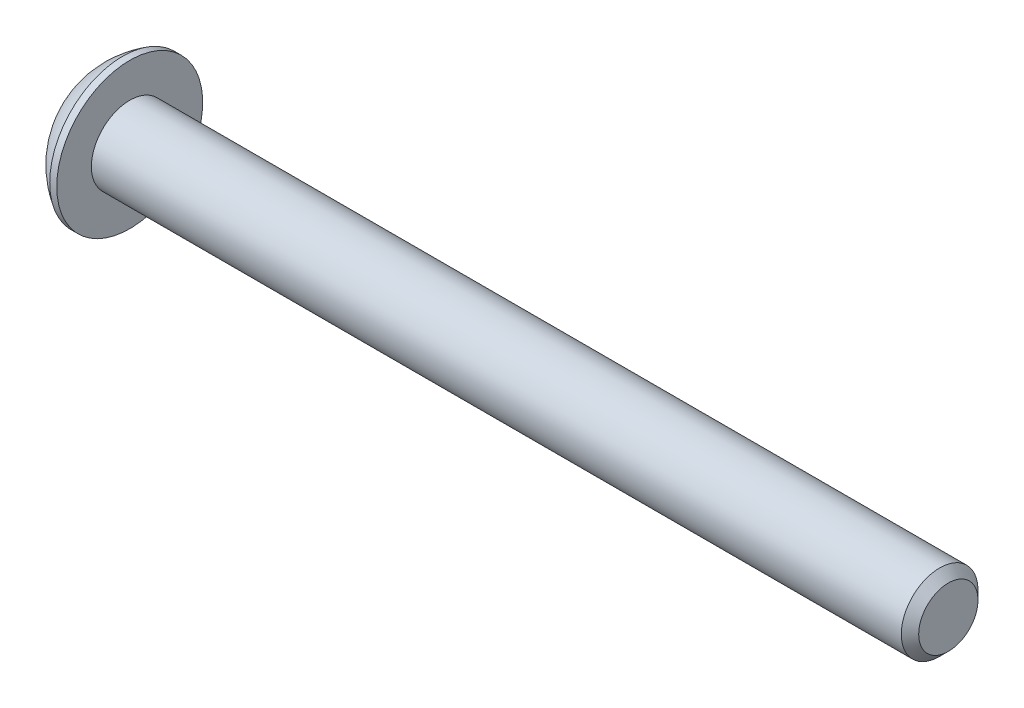
ISO-10303-21;
HEADER;
FILE_DESCRIPTION(('STEP AP214'),'2;1');
FILE_NAME('part.step','',(''),(''),'','','');
FILE_SCHEMA(('AUTOMOTIVE_DESIGN { 1 0 10303 214 1 1 1 1 }'));
ENDSEC;
DATA;
#1=APPLICATION_CONTEXT('core data for automotive mechanical design processes');
#2=APPLICATION_PROTOCOL_DEFINITION('international standard','automotive_design',2000,#1);
#3=PRODUCT_CONTEXT('',#1,'mechanical');
#4=PRODUCT('Part','Part','',(#3));
#5=PRODUCT_RELATED_PRODUCT_CATEGORY('part','',(#4));
#6=PRODUCT_DEFINITION_FORMATION('','',#4);
#7=PRODUCT_DEFINITION_CONTEXT('part definition',#1,'design');
#8=PRODUCT_DEFINITION('design','',#6,#7);
#9=PRODUCT_DEFINITION_SHAPE('','',#8);
#10=(LENGTH_UNIT() NAMED_UNIT(*) SI_UNIT(.MILLI.,.METRE.));
#11=(NAMED_UNIT(*) PLANE_ANGLE_UNIT() SI_UNIT($,.RADIAN.));
#12=(NAMED_UNIT(*) SI_UNIT($,.STERADIAN.) SOLID_ANGLE_UNIT());
#13=UNCERTAINTY_MEASURE_WITH_UNIT(LENGTH_MEASURE(1.E-05),#10,'distance_accuracy_value','');
#14=(GEOMETRIC_REPRESENTATION_CONTEXT(3) GLOBAL_UNCERTAINTY_ASSIGNED_CONTEXT((#13)) GLOBAL_UNIT_ASSIGNED_CONTEXT((#10,
#11,#12)) REPRESENTATION_CONTEXT('',''));
#15=CARTESIAN_POINT('',(0.,0.,0.));
#16=DIRECTION('',(0.,0.,1.));
#17=DIRECTION('',(1.,0.,0.));
#18=AXIS2_PLACEMENT_3D('',#15,#16,#17);
#19=CARTESIAN_POINT('',(1.32080000000034,0.,0.));
#20=DIRECTION('',(-1.,0.,0.));
#21=DIRECTION('',(0.,0.,1.));
#22=AXIS2_PLACEMENT_3D('',#19,#20,#21);
#23=CONICAL_SURFACE('',#22,1.1937999999998,1.04719755119608);
#24=CARTESIAN_POINT('',(2.01004075135902,0.,4.44089209850063E-13));
#25=VERTEX_POINT('',#24);
#26=VERTEX_LOOP('',#25);
#27=FACE_BOUND('',#26,.T.);
#28=CARTESIAN_POINT('',(1.32080000000009,0.,0.));
#29=DIRECTION('',(-1.,0.,0.));
#30=DIRECTION('',(0.,0.,1.));
#31=AXIS2_PLACEMENT_3D('',#28,#29,#30);
#32=CIRCLE('',#31,1.19380000000024);
#33=CARTESIAN_POINT('',(1.32080000000004,-1.03386112703797,0.59690000000006));
#34=VERTEX_POINT('',#33);
#35=CARTESIAN_POINT('',(1.32080000000004,0.,1.19380000000012));
#36=VERTEX_POINT('',#35);
#37=EDGE_CURVE('E20',#34,#36,#32,.T.);
#38=ORIENTED_EDGE('',*,*,#37,.T.);
#39=CARTESIAN_POINT('',(1.32080000000009,0.,0.));
#40=DIRECTION('',(-1.,0.,0.));
#41=DIRECTION('',(0.,0.,1.));
#42=AXIS2_PLACEMENT_3D('',#39,#40,#41);
#43=CIRCLE('',#42,1.19380000000024);
#44=CARTESIAN_POINT('',(1.32080000000004,1.03386112703797,0.596900000000061));
#45=VERTEX_POINT('',#44);
#46=EDGE_CURVE('E148',#36,#45,#43,.T.);
#47=ORIENTED_EDGE('',*,*,#46,.T.);
#48=CARTESIAN_POINT('',(1.32080000000009,0.,0.));
#49=DIRECTION('',(-1.,0.,0.));
#50=DIRECTION('',(0.,0.,1.));
#51=AXIS2_PLACEMENT_3D('',#48,#49,#50);
#52=CIRCLE('',#51,1.19380000000024);
#53=CARTESIAN_POINT('',(1.32080000000004,1.03386112703797,-0.596900000000061));
#54=VERTEX_POINT('',#53);
#55=EDGE_CURVE('E448',#45,#54,#52,.T.);
#56=ORIENTED_EDGE('',*,*,#55,.T.);
#57=CARTESIAN_POINT('',(1.32080000000009,0.,0.));
#58=DIRECTION('',(-1.,0.,0.));
#59=DIRECTION('',(0.,0.,1.));
#60=AXIS2_PLACEMENT_3D('',#57,#58,#59);
#61=CIRCLE('',#60,1.19380000000024);
#62=CARTESIAN_POINT('',(1.32080000000004,1.49457637585666E-12,-1.19380000000012));
#63=VERTEX_POINT('',#62);
#64=EDGE_CURVE('E449',#54,#63,#61,.T.);
#65=ORIENTED_EDGE('',*,*,#64,.T.);
#66=CARTESIAN_POINT('',(1.32080000000009,0.,0.));
#67=DIRECTION('',(-1.,0.,0.));
#68=DIRECTION('',(0.,0.,1.));
#69=AXIS2_PLACEMENT_3D('',#66,#67,#68);
#70=CIRCLE('',#69,1.19380000000024);
#71=CARTESIAN_POINT('',(1.32080000000004,-1.03386112703797,-0.59690000000006));
#72=VERTEX_POINT('',#71);
#73=EDGE_CURVE('E93',#63,#72,#70,.T.);
#74=ORIENTED_EDGE('',*,*,#73,.T.);
#75=CARTESIAN_POINT('',(1.32080000000009,0.,0.));
#76=DIRECTION('',(-1.,0.,0.));
#77=DIRECTION('',(0.,0.,1.));
#78=AXIS2_PLACEMENT_3D('',#75,#76,#77);
#79=CIRCLE('',#78,1.19380000000024);
#80=EDGE_CURVE('E89',#72,#34,#79,.T.);
#81=ORIENTED_EDGE('',*,*,#80,.T.);
#82=EDGE_LOOP('',(#38,#47,#56,#65,#74,#81));
#83=FACE_BOUND('',#82,.T.);
#84=ADVANCED_FACE('F17',(#27,#83),#23,.F.);
#85=CARTESIAN_POINT('',(1.3208,-2.06772225407572,-1.1938));
#86=DIRECTION('',(1.,0.,0.));
#87=DIRECTION('',(0.,0.,-1.));
#88=AXIS2_PLACEMENT_3D('',#85,#86,#87);
#89=PLANE('',#88);
#90=DIRECTION('',(0.,0.5,0.866025403784439));
#91=VECTOR('',#90,1.);
#92=CARTESIAN_POINT('',(1.3208,-1.37848150271715,0.));
#93=LINE('',#92,#91);
#94=CARTESIAN_POINT('',(1.3208,-0.689240751358574,1.1938));
#95=VERTEX_POINT('',#94);
#96=EDGE_CURVE('E101',#95,#34,#93,.F.);
#97=ORIENTED_EDGE('',*,*,#96,.F.);
#98=DIRECTION('',(0.,1.,0.));
#99=VECTOR('',#98,1.);
#100=CARTESIAN_POINT('',(1.3208,-0.689240751358574,1.1938));
#101=LINE('',#100,#99);
#102=EDGE_CURVE('E103',#36,#95,#101,.F.);
#103=ORIENTED_EDGE('',*,*,#102,.F.);
#104=ORIENTED_EDGE('',*,*,#37,.F.);
#105=EDGE_LOOP('',(#97,#103,#104));
#106=FACE_BOUND('',#105,.T.);
#107=ADVANCED_FACE('F99',(#106),#89,.F.);
#108=CARTESIAN_POINT('',(1.3208,-2.06772225407572,-1.1938));
#109=DIRECTION('',(1.,0.,0.));
#110=DIRECTION('',(0.,0.,-1.));
#111=AXIS2_PLACEMENT_3D('',#108,#109,#110);
#112=PLANE('',#111);
#113=DIRECTION('',(0.,-0.5,0.866025403784439));
#114=VECTOR('',#113,1.);
#115=CARTESIAN_POINT('',(1.3208,-0.689240751358574,-1.1938));
#116=LINE('',#115,#114);
#117=CARTESIAN_POINT('',(1.3208,-1.37848150271715,0.));
#118=VERTEX_POINT('',#117);
#119=EDGE_CURVE('E109',#118,#72,#116,.F.);
#120=ORIENTED_EDGE('',*,*,#119,.F.);
#121=DIRECTION('',(0.,0.5,0.866025403784439));
#122=VECTOR('',#121,1.);
#123=CARTESIAN_POINT('',(1.3208,-1.37848150271715,0.));
#124=LINE('',#123,#122);
#125=EDGE_CURVE('E106',#34,#118,#124,.F.);
#126=ORIENTED_EDGE('',*,*,#125,.F.);
#127=ORIENTED_EDGE('',*,*,#80,.F.);
#128=EDGE_LOOP('',(#120,#126,#127));
#129=FACE_BOUND('',#128,.T.);
#130=ADVANCED_FACE('F107',(#129),#112,.F.);
#131=CARTESIAN_POINT('',(1.3208,-2.06772225407572,-1.1938));
#132=DIRECTION('',(1.,0.,0.));
#133=DIRECTION('',(0.,0.,-1.));
#134=AXIS2_PLACEMENT_3D('',#131,#132,#133);
#135=PLANE('',#134);
#136=DIRECTION('',(0.,1.,0.));
#137=VECTOR('',#136,1.);
#138=CARTESIAN_POINT('',(1.3208,0.689240751358577,-1.1938));
#139=LINE('',#138,#137);
#140=CARTESIAN_POINT('',(1.3208,-0.689240751358574,-1.1938));
#141=VERTEX_POINT('',#140);
#142=EDGE_CURVE('E419',#141,#63,#139,.T.);
#143=ORIENTED_EDGE('',*,*,#142,.F.);
#144=DIRECTION('',(0.,-0.5,0.866025403784439));
#145=VECTOR('',#144,1.);
#146=CARTESIAN_POINT('',(1.3208,-0.689240751358574,-1.1938));
#147=LINE('',#146,#145);
#148=EDGE_CURVE('E431',#72,#141,#147,.F.);
#149=ORIENTED_EDGE('',*,*,#148,.F.);
#150=ORIENTED_EDGE('',*,*,#73,.F.);
#151=EDGE_LOOP('',(#143,#149,#150));
#152=FACE_BOUND('',#151,.T.);
#153=ADVANCED_FACE('F191',(#152),#135,.F.);
#154=CARTESIAN_POINT('',(1.3208,-2.06772225407572,-1.1938));
#155=DIRECTION('',(1.,0.,0.));
#156=DIRECTION('',(0.,0.,-1.));
#157=AXIS2_PLACEMENT_3D('',#154,#155,#156);
#158=PLANE('',#157);
#159=DIRECTION('',(0.,-0.5,-0.866025403784439));
#160=VECTOR('',#159,1.);
#161=CARTESIAN_POINT('',(1.3208,1.37848150271715,0.));
#162=LINE('',#161,#160);
#163=CARTESIAN_POINT('',(1.3208,0.689240751358577,-1.1938));
#164=VERTEX_POINT('',#163);
#165=EDGE_CURVE('E405',#164,#54,#162,.F.);
#166=ORIENTED_EDGE('',*,*,#165,.F.);
#167=DIRECTION('',(0.,1.,0.));
#168=VECTOR('',#167,1.);
#169=CARTESIAN_POINT('',(1.3208,0.689240751358577,-1.1938));
#170=LINE('',#169,#168);
#171=EDGE_CURVE('E416',#63,#164,#170,.T.);
#172=ORIENTED_EDGE('',*,*,#171,.F.);
#173=ORIENTED_EDGE('',*,*,#64,.F.);
#174=EDGE_LOOP('',(#166,#172,#173));
#175=FACE_BOUND('',#174,.T.);
#176=ADVANCED_FACE('F187',(#175),#158,.F.);
#177=CARTESIAN_POINT('',(1.3208,-2.06772225407572,-1.1938));
#178=DIRECTION('',(1.,0.,0.));
#179=DIRECTION('',(0.,0.,-1.));
#180=AXIS2_PLACEMENT_3D('',#177,#178,#179);
#181=PLANE('',#180);
#182=DIRECTION('',(0.,0.5,-0.866025403784439));
#183=VECTOR('',#182,1.);
#184=CARTESIAN_POINT('',(1.3208,0.689240751358576,1.1938));
#185=LINE('',#184,#183);
#186=CARTESIAN_POINT('',(1.3208,1.37848150271715,0.));
#187=VERTEX_POINT('',#186);
#188=EDGE_CURVE('E384',#187,#45,#185,.F.);
#189=ORIENTED_EDGE('',*,*,#188,.F.);
#190=DIRECTION('',(0.,-0.5,-0.866025403784439));
#191=VECTOR('',#190,1.);
#192=CARTESIAN_POINT('',(1.3208,1.37848150271715,0.));
#193=LINE('',#192,#191);
#194=EDGE_CURVE('E403',#54,#187,#193,.F.);
#195=ORIENTED_EDGE('',*,*,#194,.F.);
#196=ORIENTED_EDGE('',*,*,#55,.F.);
#197=EDGE_LOOP('',(#189,#195,#196));
#198=FACE_BOUND('',#197,.T.);
#199=ADVANCED_FACE('F183',(#198),#181,.F.);
#200=CARTESIAN_POINT('',(1.3208,-2.06772225407572,-1.1938));
#201=DIRECTION('',(1.,0.,0.));
#202=DIRECTION('',(0.,0.,-1.));
#203=AXIS2_PLACEMENT_3D('',#200,#201,#202);
#204=PLANE('',#203);
#205=DIRECTION('',(0.,1.,0.));
#206=VECTOR('',#205,1.);
#207=CARTESIAN_POINT('',(1.3208,-0.689240751358574,1.1938));
#208=LINE('',#207,#206);
#209=CARTESIAN_POINT('',(1.3208,0.689240751358576,1.1938));
#210=VERTEX_POINT('',#209);
#211=EDGE_CURVE('E118',#210,#36,#208,.F.);
#212=ORIENTED_EDGE('',*,*,#211,.F.);
#213=DIRECTION('',(0.,0.5,-0.866025403784439));
#214=VECTOR('',#213,1.);
#215=CARTESIAN_POINT('',(1.3208,0.689240751358576,1.1938));
#216=LINE('',#215,#214);
#217=EDGE_CURVE('E387',#45,#210,#216,.F.);
#218=ORIENTED_EDGE('',*,*,#217,.F.);
#219=ORIENTED_EDGE('',*,*,#46,.F.);
#220=EDGE_LOOP('',(#212,#218,#219));
#221=FACE_BOUND('',#220,.T.);
#222=ADVANCED_FACE('F179',(#221),#204,.F.);
#223=CARTESIAN_POINT('',(1.3208,-0.689240751358574,1.1938));
#224=DIRECTION('',(0.,0.,-1.));
#225=DIRECTION('',(0.,1.,0.));
#226=AXIS2_PLACEMENT_3D('',#223,#224,#225);
#227=PLANE('',#226);
#228=DIRECTION('',(0.,1.,0.));
#229=VECTOR('',#228,1.);
#230=CARTESIAN_POINT('',(0.,0.,1.1938));
#231=LINE('',#230,#229);
#232=CARTESIAN_POINT('',(0.,0.689240751358577,1.1938));
#233=VERTEX_POINT('',#232);
#234=CARTESIAN_POINT('',(0.,-0.689240751358574,1.1938));
#235=VERTEX_POINT('',#234);
#236=EDGE_CURVE('E381',#233,#235,#231,.F.);
#237=ORIENTED_EDGE('',*,*,#236,.F.);
#238=DIRECTION('',(1.,0.,0.));
#239=VECTOR('',#238,1.);
#240=CARTESIAN_POINT('',(1.3208,0.689240751358576,1.1938));
#241=LINE('',#240,#239);
#242=EDGE_CURVE('E393',#210,#233,#241,.F.);
#243=ORIENTED_EDGE('',*,*,#242,.F.);
#244=ORIENTED_EDGE('',*,*,#211,.T.);
#245=ORIENTED_EDGE('',*,*,#102,.T.);
#246=DIRECTION('',(1.,0.,0.));
#247=VECTOR('',#246,1.);
#248=CARTESIAN_POINT('',(1.3208,-0.689240751358574,1.1938));
#249=LINE('',#248,#247);
#250=EDGE_CURVE('E112',#235,#95,#249,.T.);
#251=ORIENTED_EDGE('',*,*,#250,.F.);
#252=EDGE_LOOP('',(#237,#243,#244,#245,#251));
#253=FACE_BOUND('',#252,.T.);
#254=ADVANCED_FACE('F176',(#253),#227,.T.);
#255=CARTESIAN_POINT('',(1.3208,-1.37848150271715,0.));
#256=DIRECTION('',(0.,0.866025403784439,-0.5));
#257=DIRECTION('',(0.,0.5,0.866025403784439));
#258=AXIS2_PLACEMENT_3D('',#255,#256,#257);
#259=PLANE('',#258);
#260=DIRECTION('',(0.,-0.5,-0.866025403784439));
#261=VECTOR('',#260,1.);
#262=CARTESIAN_POINT('',(0.,-0.689240751358574,1.1938));
#263=LINE('',#262,#261);
#264=CARTESIAN_POINT('',(0.,-1.37848150271715,0.));
#265=VERTEX_POINT('',#264);
#266=EDGE_CURVE('E378',#235,#265,#263,.T.);
#267=ORIENTED_EDGE('',*,*,#266,.F.);
#268=ORIENTED_EDGE('',*,*,#250,.T.);
#269=ORIENTED_EDGE('',*,*,#96,.T.);
#270=ORIENTED_EDGE('',*,*,#125,.T.);
#271=DIRECTION('',(1.,0.,0.));
#272=VECTOR('',#271,1.);
#273=CARTESIAN_POINT('',(1.3208,-1.37848150271715,0.));
#274=LINE('',#273,#272);
#275=EDGE_CURVE('E428',#265,#118,#274,.T.);
#276=ORIENTED_EDGE('',*,*,#275,.F.);
#277=EDGE_LOOP('',(#267,#268,#269,#270,#276));
#278=FACE_BOUND('',#277,.T.);
#279=ADVANCED_FACE('F116',(#278),#259,.T.);
#280=CARTESIAN_POINT('',(1.3208,-0.689240751358574,-1.1938));
#281=DIRECTION('',(0.,0.866025403784439,0.5));
#282=DIRECTION('',(0.,-0.5,0.866025403784439));
#283=AXIS2_PLACEMENT_3D('',#280,#281,#282);
#284=PLANE('',#283);
#285=DIRECTION('',(0.,0.5,-0.866025403784439));
#286=VECTOR('',#285,1.);
#287=CARTESIAN_POINT('',(0.,-1.37848150271715,0.));
#288=LINE('',#287,#286);
#289=CARTESIAN_POINT('',(0.,-0.689240751358574,-1.1938));
#290=VERTEX_POINT('',#289);
#291=EDGE_CURVE('E375',#265,#290,#288,.T.);
#292=ORIENTED_EDGE('',*,*,#291,.F.);
#293=ORIENTED_EDGE('',*,*,#275,.T.);
#294=ORIENTED_EDGE('',*,*,#119,.T.);
#295=ORIENTED_EDGE('',*,*,#148,.T.);
#296=DIRECTION('',(1.,0.,0.));
#297=VECTOR('',#296,1.);
#298=CARTESIAN_POINT('',(1.3208,-0.689240751358574,-1.1938));
#299=LINE('',#298,#297);
#300=EDGE_CURVE('E413',#290,#141,#299,.T.);
#301=ORIENTED_EDGE('',*,*,#300,.F.);
#302=EDGE_LOOP('',(#292,#293,#294,#295,#301));
#303=FACE_BOUND('',#302,.T.);
#304=ADVANCED_FACE('F169',(#303),#284,.T.);
#305=CARTESIAN_POINT('',(1.3208,0.689240751358577,-1.1938));
#306=DIRECTION('',(0.,0.,1.));
#307=DIRECTION('',(1.,0.,0.));
#308=AXIS2_PLACEMENT_3D('',#305,#306,#307);
#309=PLANE('',#308);
#310=DIRECTION('',(0.,1.,0.));
#311=VECTOR('',#310,1.);
#312=CARTESIAN_POINT('',(0.,0.,-1.1938));
#313=LINE('',#312,#311);
#314=CARTESIAN_POINT('',(0.,0.689240751358577,-1.1938));
#315=VERTEX_POINT('',#314);
#316=EDGE_CURVE('E372',#290,#315,#313,.T.);
#317=ORIENTED_EDGE('',*,*,#316,.F.);
#318=ORIENTED_EDGE('',*,*,#300,.T.);
#319=ORIENTED_EDGE('',*,*,#142,.T.);
#320=ORIENTED_EDGE('',*,*,#171,.T.);
#321=DIRECTION('',(1.,0.,0.));
#322=VECTOR('',#321,1.);
#323=CARTESIAN_POINT('',(1.3208,0.689240751358577,-1.1938));
#324=LINE('',#323,#322);
#325=EDGE_CURVE('E388',#315,#164,#324,.T.);
#326=ORIENTED_EDGE('',*,*,#325,.F.);
#327=EDGE_LOOP('',(#317,#318,#319,#320,#326));
#328=FACE_BOUND('',#327,.T.);
#329=ADVANCED_FACE('F166',(#328),#309,.T.);
#330=CARTESIAN_POINT('',(1.3208,1.37848150271715,0.));
#331=DIRECTION('',(0.,-0.866025403784439,0.5));
#332=DIRECTION('',(0.,-0.5,-0.866025403784439));
#333=AXIS2_PLACEMENT_3D('',#330,#331,#332);
#334=PLANE('',#333);
#335=DIRECTION('',(0.,0.5,0.866025403784439));
#336=VECTOR('',#335,1.);
#337=CARTESIAN_POINT('',(0.,0.689240751358577,-1.1938));
#338=LINE('',#337,#336);
#339=CARTESIAN_POINT('',(0.,1.37848150271715,0.));
#340=VERTEX_POINT('',#339);
#341=EDGE_CURVE('E369',#315,#340,#338,.T.);
#342=ORIENTED_EDGE('',*,*,#341,.F.);
#343=ORIENTED_EDGE('',*,*,#325,.T.);
#344=ORIENTED_EDGE('',*,*,#165,.T.);
#345=ORIENTED_EDGE('',*,*,#194,.T.);
#346=DIRECTION('',(1.,0.,0.));
#347=VECTOR('',#346,1.);
#348=CARTESIAN_POINT('',(1.3208,1.37848150271715,0.));
#349=LINE('',#348,#347);
#350=EDGE_CURVE('E35',#340,#187,#349,.T.);
#351=ORIENTED_EDGE('',*,*,#350,.F.);
#352=EDGE_LOOP('',(#342,#343,#344,#345,#351));
#353=FACE_BOUND('',#352,.T.);
#354=ADVANCED_FACE('F162',(#353),#334,.T.);
#355=CARTESIAN_POINT('',(1.3208,0.689240751358576,1.1938));
#356=DIRECTION('',(0.,-0.866025403784439,-0.5));
#357=DIRECTION('',(0.,0.5,-0.866025403784439));
#358=AXIS2_PLACEMENT_3D('',#355,#356,#357);
#359=PLANE('',#358);
#360=DIRECTION('',(0.,-0.5,0.866025403784439));
#361=VECTOR('',#360,1.);
#362=CARTESIAN_POINT('',(0.,1.37848150271715,0.));
#363=LINE('',#362,#361);
#364=EDGE_CURVE('E147',#340,#233,#363,.T.);
#365=ORIENTED_EDGE('',*,*,#364,.F.);
#366=ORIENTED_EDGE('',*,*,#350,.T.);
#367=ORIENTED_EDGE('',*,*,#188,.T.);
#368=ORIENTED_EDGE('',*,*,#217,.T.);
#369=ORIENTED_EDGE('',*,*,#242,.T.);
#370=EDGE_LOOP('',(#365,#366,#367,#368,#369));
#371=FACE_BOUND('',#370,.T.);
#372=ADVANCED_FACE('F158',(#371),#359,.T.);
#373=CARTESIAN_POINT('',(0.,0.,0.));
#374=DIRECTION('',(-1.,0.,0.));
#375=DIRECTION('',(0.,0.,1.));
#376=AXIS2_PLACEMENT_3D('',#373,#374,#375);
#377=PLANE('',#376);
#378=ORIENTED_EDGE('',*,*,#341,.T.);
#379=ORIENTED_EDGE('',*,*,#364,.T.);
#380=ORIENTED_EDGE('',*,*,#236,.T.);
#381=ORIENTED_EDGE('',*,*,#266,.T.);
#382=ORIENTED_EDGE('',*,*,#291,.T.);
#383=ORIENTED_EDGE('',*,*,#316,.T.);
#384=EDGE_LOOP('',(#378,#379,#380,#381,#382,#383));
#385=FACE_BOUND('',#384,.T.);
#386=CARTESIAN_POINT('',(0.,1.9812,0.));
#387=CARTESIAN_POINT('',(0.,1.9811996664299,0.0556258831179428));
#388=CARTESIAN_POINT('',(0.,1.97885520380442,0.111261989398606));
#389=CARTESIAN_POINT('',(0.,1.96949260169541,0.222149719830458));
#390=CARTESIAN_POINT('',(0.,1.96247308239605,0.277401225602895));
#391=CARTESIAN_POINT('',(0.,1.94379192841038,0.387209508139747));
#392=CARTESIAN_POINT('',(-1.85325793235264E-13,1.93212292489526,0.441765039546365));
#393=CARTESIAN_POINT('',(1.86344214223505E-13,1.90422331175315,0.549729449347493));
#394=CARTESIAN_POINT('',(6.94543371897454E-13,1.88798900035338,0.603137359208869));
#395=CARTESIAN_POINT('',(1.15501975216981E-12,1.83266214476501,0.760839131321828));
#396=CARTESIAN_POINT('',(0.,1.78690023648845,0.862876433575429));
#397=CARTESIAN_POINT('',(0.,1.67887358150667,1.05780719540872));
#398=CARTESIAN_POINT('',(9.54193214892627E-13,1.6166082074585,1.15070030720801));
#399=CARTESIAN_POINT('',(5.94805591894675E-13,1.51224157140982,1.28116890915697));
#400=CARTESIAN_POINT('',(1.63221293851378E-13,1.4755970394354,1.32320451127026));
#401=CARTESIAN_POINT('',(-1.62196980336157E-13,1.39893832619713,1.40400288695709));
#402=CARTESIAN_POINT('',(0.,1.35892742784698,1.44276877695455));
#403=CARTESIAN_POINT('',(1.14362537325405E-13,1.23416504602197,1.55382272417904));
#404=CARTESIAN_POINT('',(0.,1.14466125559859,1.62089527952111));
#405=CARTESIAN_POINT('',(0.,0.955712144178167,1.7390221808118));
#406=CARTESIAN_POINT('',(0.,0.856267198233564,1.79007713076007));
#407=CARTESIAN_POINT('',(0.,0.650206345910843,1.87477637530954));
#408=CARTESIAN_POINT('',(0.,0.543590516134855,1.90842085586267));
#409=CARTESIAN_POINT('',(0.,0.326226155292018,1.95733039300656));
#410=CARTESIAN_POINT('',(0.,0.21547760215793,1.97259535144288));
#411=CARTESIAN_POINT('',(0.,-0.00701040587544639,1.98431697865418));
#412=CARTESIAN_POINT('',(0.,-0.118749860774734,1.98077364742917));
#413=CARTESIAN_POINT('',(0.,-0.340050178355485,1.95497485623825));
#414=CARTESIAN_POINT('',(0.,-0.449611052668255,1.93271949620218));
#415=CARTESIAN_POINT('',(0.,-0.663431110729174,1.87014138774523));
#416=CARTESIAN_POINT('',(0.,-0.76769023783852,1.82981844635272));
#417=CARTESIAN_POINT('',(0.,-0.968005760719347,1.73219968377096));
#418=CARTESIAN_POINT('',(0.,-1.0640618469811,1.6749032225164));
#419=CARTESIAN_POINT('',(0.,-1.19980276751283,1.57757371205873));
#420=CARTESIAN_POINT('',(0.,-1.24366557129213,1.54322665019466));
#421=CARTESIAN_POINT('',(0.,-1.32838995706696,1.47093063174264));
#422=CARTESIAN_POINT('',(0.,-1.36924860178706,1.43297823102439));
#423=CARTESIAN_POINT('',(0.,-1.48674671849223,1.31419842051173));
#424=CARTESIAN_POINT('',(0.,-1.55842832343237,1.22836221289311));
#425=CARTESIAN_POINT('',(0.,-1.6863396856475,1.04586168272493));
#426=CARTESIAN_POINT('',(0.,-1.7425700302488,0.949197771949774));
#427=CARTESIAN_POINT('',(0.,-1.8141614250401,0.798182600298684));
#428=CARTESIAN_POINT('',(0.,-1.83591780585875,0.746776203847791));
#429=CARTESIAN_POINT('',(0.,-1.87500754181092,0.642341081688636));
#430=CARTESIAN_POINT('',(0.,-1.89234447645404,0.589313708122847));
#431=CARTESIAN_POINT('',(0.,-1.92246053433554,0.482076273028395));
#432=CARTESIAN_POINT('',(0.,-1.93524685475118,0.42786822425751));
#433=CARTESIAN_POINT('',(0.,-1.95620937250494,0.318578151844611));
#434=CARTESIAN_POINT('',(0.,-1.96438692958147,0.263496390912872));
#435=CARTESIAN_POINT('',(0.,-1.97388528284653,0.173607715038558));
#436=CARTESIAN_POINT('',(0.,-1.97662743364426,0.138944718024998));
#437=CARTESIAN_POINT('',(0.,-1.98028489645283,0.0695224782567002));
#438=CARTESIAN_POINT('',(0.,-1.98120020846367,0.0347632355019631));
#439=CARTESIAN_POINT('',(0.,-1.9811996664299,-0.0556258831179437));
#440=CARTESIAN_POINT('',(0.,-1.97885520380442,-0.111261989398607));
#441=CARTESIAN_POINT('',(0.,-1.96949260169541,-0.222149719830459));
#442=CARTESIAN_POINT('',(0.,-1.96247308239605,-0.277401225602897));
#443=CARTESIAN_POINT('',(0.,-1.94379192841039,-0.387209508139749));
#444=CARTESIAN_POINT('',(-1.85269749640691E-13,-1.93212292489526,-0.441765039546367));
#445=CARTESIAN_POINT('',(1.86288125054388E-13,-1.90422331175315,-0.549729449347495));
#446=CARTESIAN_POINT('',(6.94525090263764E-13,-1.88798900035338,-0.603137359208872));
#447=CARTESIAN_POINT('',(1.15505622829081E-12,-1.83266214476501,-0.760839131321831));
#448=CARTESIAN_POINT('',(0.,-1.78690023648845,-0.862876433575431));
#449=CARTESIAN_POINT('',(0.,-1.67887358150667,-1.05780719540872));
#450=CARTESIAN_POINT('',(9.54248812869379E-13,-1.6166082074585,-1.15070030720801));
#451=CARTESIAN_POINT('',(5.94777756479239E-13,-1.51224157140982,-1.28116890915698));
#452=CARTESIAN_POINT('',(1.63138949183833E-13,-1.47559703943539,-1.32320451127027));
#453=CARTESIAN_POINT('',(-1.62114715061273E-13,-1.39893832619713,-1.40400288695709));
#454=CARTESIAN_POINT('',(0.,-1.35892742784699,-1.44276877695455));
#455=CARTESIAN_POINT('',(1.13760489124207E-13,-1.23416504602197,-1.55382272417904));
#456=CARTESIAN_POINT('',(0.,-1.14466125559859,-1.62089527952111));
#457=CARTESIAN_POINT('',(0.,-0.95571214417816,-1.73902218081179));
#458=CARTESIAN_POINT('',(0.,-0.856267198233559,-1.79007713076007));
#459=CARTESIAN_POINT('',(0.,-0.650206345910841,-1.87477637530954));
#460=CARTESIAN_POINT('',(0.,-0.543590516134854,-1.90842085586267));
#461=CARTESIAN_POINT('',(0.,-0.326226155292018,-1.95733039300657));
#462=CARTESIAN_POINT('',(0.,-0.215477602157929,-1.97259535144288));
#463=CARTESIAN_POINT('',(0.,0.0070104058754487,-1.98431697865418));
#464=CARTESIAN_POINT('',(0.,0.118749860774737,-1.98077364742916));
#465=CARTESIAN_POINT('',(0.,0.340050178355489,-1.95497485623824));
#466=CARTESIAN_POINT('',(0.,0.44961105266826,-1.93271949620218));
#467=CARTESIAN_POINT('',(0.,0.663431110729178,-1.87014138774524));
#468=CARTESIAN_POINT('',(0.,0.767690237838524,-1.82981844635272));
#469=CARTESIAN_POINT('',(0.,0.968005760719348,-1.73219968377096));
#470=CARTESIAN_POINT('',(0.,1.0640618469811,-1.67490322251639));
#471=CARTESIAN_POINT('',(0.,1.19980276751283,-1.57757371205873));
#472=CARTESIAN_POINT('',(0.,1.24366557129214,-1.54322665019465));
#473=CARTESIAN_POINT('',(0.,1.32838995706696,-1.47093063174263));
#474=CARTESIAN_POINT('',(0.,1.36924860178706,-1.43297823102439));
#475=CARTESIAN_POINT('',(0.,1.48674671849223,-1.31419842051172));
#476=CARTESIAN_POINT('',(0.,1.55842832343237,-1.22836221289311));
#477=CARTESIAN_POINT('',(0.,1.6863396856475,-1.04586168272492));
#478=CARTESIAN_POINT('',(0.,1.7425700302488,-0.949197771949768));
#479=CARTESIAN_POINT('',(0.,1.8141614250401,-0.798182600298677));
#480=CARTESIAN_POINT('',(0.,1.83591780585875,-0.746776203847785));
#481=CARTESIAN_POINT('',(0.,1.87500754181092,-0.64234108168863));
#482=CARTESIAN_POINT('',(0.,1.89234447645404,-0.589313708122841));
#483=CARTESIAN_POINT('',(0.,1.92246053433555,-0.482076273028389));
#484=CARTESIAN_POINT('',(0.,1.93524685475118,-0.427868224257505));
#485=CARTESIAN_POINT('',(0.,1.95620937250494,-0.318578151844605));
#486=CARTESIAN_POINT('',(0.,1.96438692958147,-0.263496390912866));
#487=CARTESIAN_POINT('',(0.,1.97388528284653,-0.173607715038553));
#488=CARTESIAN_POINT('',(0.,1.97662743364426,-0.138944718024994));
#489=CARTESIAN_POINT('',(0.,1.98028489645283,-0.0695224782566989));
#490=CARTESIAN_POINT('',(0.,1.98120020846367,-0.034763235501963));
#491=CARTESIAN_POINT('',(0.,1.9812,0.));
#492=B_SPLINE_CURVE_WITH_KNOTS('',3,(#386,#387,#388,#389,#390,#391,#392,#393,#394,#395,#396,
#397,#398,#399,#400,#401,#402,#403,#404,#405,#406,#407,#408,#409,#410,#411,#412,#413,#414,#415,
#416,#417,#418,#419,#420,#421,#422,#423,#424,#425,#426,#427,#428,#429,#430,#431,#432,#433,#434,
#435,#436,#437,#438,#439,#440,#441,#442,#443,#444,#445,#446,#447,#448,#449,#450,#451,#452,#453,
#454,#455,#456,#457,#458,#459,#460,#461,#462,#463,#464,#465,#466,#467,#468,#469,#470,#471,#472,
#473,#474,#475,#476,#477,#478,#479,#480,#481,#482,#483,#484,#485,#486,#487,#488,#489,#490,#491),
.UNSPECIFIED.,.T.,.F.,(4,2,2,2,2,2,2,2,2,2,2,2,2,2,2,2,2,2,2,2,2,2,2,2,2,2,2,2,2,2,2,2,2,2,2,2,
2,2,2,2,2,2,2,2,2,2,2,2,2,2,2,2,4),(0.,0.166845646007828,0.333740557374255,0.500901034367693,
0.668197445942386,1.00199278686282,1.33580081809885,1.50292354032982,1.6698851310853,
2.00370118900129,2.33750465770544,2.67130456115909,3.005106247238,3.33890793331696,
3.67270783677065,4.00651130547476,4.34032736339026,4.50728895414554,4.67441167637632,
5.00821970761259,5.34201504853332,5.50931146010827,5.67647193710191,5.84336684846844,
6.0102124944764,6.11448220058334,6.21875190669029,6.38559755269812,6.55249246406454,
6.71965294105798,6.88694935263268,7.22074469355311,7.55455272478915,7.72167544702011,
7.88863703777559,8.22245309569158,8.55625656439573,8.89005646784938,9.2238581539283,
9.55765984000725,9.89145974346094,10.2252632121651,10.5590792700806,10.7260408608358,
10.8931635830666,11.2269716143029,11.5607669552236,11.7280633667986,11.8952238437922,
12.0621187551587,12.2289644011667,12.3332341072736,12.4375038133806),.UNSPECIFIED.);
#493=CARTESIAN_POINT('',(0.,1.9812,0.));
#494=VERTEX_POINT('',#493);
#495=EDGE_CURVE('E140',#494,#494,#492,.T.);
#496=ORIENTED_EDGE('',*,*,#495,.F.);
#497=EDGE_LOOP('',(#496));
#498=FACE_BOUND('',#497,.T.);
#499=ADVANCED_FACE('F154',(#385,#498),#377,.T.);
#500=CARTESIAN_POINT('',(4.13385,0.,0.));
#501=DIRECTION('',(0.,1.,0.));
#502=DIRECTION('',(1.,0.,0.));
#503=AXIS2_PLACEMENT_3D('',#500,#501,#502);
#504=SPHERICAL_SURFACE('',#503,4.58408870578439);
#505=CARTESIAN_POINT('',(1.8288,0.,0.));
#506=DIRECTION('',(-1.,0.,0.));
#507=DIRECTION('',(0.,0.,1.));
#508=AXIS2_PLACEMENT_3D('',#505,#506,#507);
#509=CIRCLE('',#508,3.9624);
#510=CARTESIAN_POINT('',(1.8288,0.,3.9624));
#511=VERTEX_POINT('',#510);
#512=EDGE_CURVE('E137',#511,#511,#509,.F.);
#513=ORIENTED_EDGE('',*,*,#512,.F.);
#514=EDGE_LOOP('',(#513));
#515=FACE_BOUND('',#514,.T.);
#516=ORIENTED_EDGE('',*,*,#495,.T.);
#517=EDGE_LOOP('',(#516));
#518=FACE_BOUND('',#517,.T.);
#519=ADVANCED_FACE('F150',(#515,#518),#504,.T.);
#520=CARTESIAN_POINT('',(46.6598,0.,0.));
#521=DIRECTION('',(-1.,0.,0.));
#522=DIRECTION('',(0.,0.,1.));
#523=AXIS2_PLACEMENT_3D('',#520,#521,#522);
#524=PLANE('',#523);
#525=CARTESIAN_POINT('',(46.6597999999863,0.,0.));
#526=DIRECTION('',(-1.,0.,0.));
#527=DIRECTION('',(0.,0.,1.));
#528=AXIS2_PLACEMENT_3D('',#525,#526,#527);
#529=CIRCLE('',#528,1.61036000002923);
#530=CARTESIAN_POINT('',(46.6597999999863,0.,1.61036000002923));
#531=VERTEX_POINT('',#530);
#532=EDGE_CURVE('E134',#531,#531,#529,.T.);
#533=ORIENTED_EDGE('',*,*,#532,.F.);
#534=EDGE_LOOP('',(#533));
#535=FACE_BOUND('',#534,.T.);
#536=ADVANCED_FACE('F221',(#535),#524,.F.);
#537=CARTESIAN_POINT('',(0.,0.,0.));
#538=DIRECTION('',(-1.,0.,0.));
#539=DIRECTION('',(0.,0.,1.));
#540=AXIS2_PLACEMENT_3D('',#537,#538,#539);
#541=CYLINDRICAL_SURFACE('',#540,3.9624);
#542=ORIENTED_EDGE('',*,*,#512,.T.);
#543=EDGE_LOOP('',(#542));
#544=FACE_BOUND('',#543,.T.);
#545=CARTESIAN_POINT('',(2.2098,0.,0.));
#546=DIRECTION('',(-1.,0.,0.));
#547=DIRECTION('',(0.,0.,1.));
#548=AXIS2_PLACEMENT_3D('',#545,#546,#547);
#549=CIRCLE('',#548,3.9624);
#550=CARTESIAN_POINT('',(2.2098,0.,3.9624));
#551=VERTEX_POINT('',#550);
#552=EDGE_CURVE('E131',#551,#551,#549,.T.);
#553=ORIENTED_EDGE('',*,*,#552,.T.);
#554=EDGE_LOOP('',(#553));
#555=FACE_BOUND('',#554,.T.);
#556=ADVANCED_FACE('F218',(#544,#555),#541,.T.);
#557=CARTESIAN_POINT('',(46.1873600000899,0.,0.));
#558=DIRECTION('',(-1.,0.,0.));
#559=DIRECTION('',(0.,0.,1.));
#560=AXIS2_PLACEMENT_3D('',#557,#558,#559);
#561=CONICAL_SURFACE('',#560,2.08279999992556,0.785398163397448);
#562=CARTESIAN_POINT('',(46.18736,0.,0.));
#563=DIRECTION('',(-1.,0.,0.));
#564=DIRECTION('',(0.,0.,1.));
#565=AXIS2_PLACEMENT_3D('',#562,#563,#564);
#566=CIRCLE('',#565,2.0828);
#567=CARTESIAN_POINT('',(46.18736,0.,2.0828));
#568=VERTEX_POINT('',#567);
#569=EDGE_CURVE('E26',#568,#568,#566,.T.);
#570=ORIENTED_EDGE('',*,*,#569,.F.);
#571=EDGE_LOOP('',(#570));
#572=FACE_BOUND('',#571,.T.);
#573=ORIENTED_EDGE('',*,*,#532,.T.);
#574=EDGE_LOOP('',(#573));
#575=FACE_BOUND('',#574,.T.);
#576=ADVANCED_FACE('F211',(#572,#575),#561,.T.);
#577=CARTESIAN_POINT('',(2.2098,2.0828,0.));
#578=DIRECTION('',(-1.,0.,0.));
#579=DIRECTION('',(0.,0.,1.));
#580=AXIS2_PLACEMENT_3D('',#577,#578,#579);
#581=PLANE('',#580);
#582=CARTESIAN_POINT('',(2.2098,0.,0.));
#583=DIRECTION('',(-1.,0.,0.));
#584=DIRECTION('',(0.,0.,1.));
#585=AXIS2_PLACEMENT_3D('',#582,#583,#584);
#586=CIRCLE('',#585,2.0828);
#587=CARTESIAN_POINT('',(2.2098,0.,2.0828));
#588=VERTEX_POINT('',#587);
#589=EDGE_CURVE('E10',#588,#588,#586,.F.);
#590=ORIENTED_EDGE('',*,*,#589,.F.);
#591=EDGE_LOOP('',(#590));
#592=FACE_BOUND('',#591,.T.);
#593=ORIENTED_EDGE('',*,*,#552,.F.);
#594=EDGE_LOOP('',(#593));
#595=FACE_BOUND('',#594,.T.);
#596=ADVANCED_FACE('F205',(#592,#595),#581,.F.);
#597=CARTESIAN_POINT('',(0.,0.,0.));
#598=DIRECTION('',(-1.,0.,0.));
#599=DIRECTION('',(0.,0.,1.));
#600=AXIS2_PLACEMENT_3D('',#597,#598,#599);
#601=CYLINDRICAL_SURFACE('',#600,2.0828);
#602=ORIENTED_EDGE('',*,*,#589,.T.);
#603=EDGE_LOOP('',(#602));
#604=FACE_BOUND('',#603,.T.);
#605=ORIENTED_EDGE('',*,*,#569,.T.);
#606=EDGE_LOOP('',(#605));
#607=FACE_BOUND('',#606,.T.);
#608=ADVANCED_FACE('F203',(#604,#607),#601,.T.);
#609=CLOSED_SHELL('',(#84,#107,#130,#153,#176,#199,#222,#254,#279,#304,#329,#354,#372,#499,#519,
#536,#556,#576,#596,#608));
#610=MANIFOLD_SOLID_BREP('B1',#609);
#611=ADVANCED_BREP_SHAPE_REPRESENTATION('',(#18,#610),#14);
#612=SHAPE_DEFINITION_REPRESENTATION(#9,#611);
ENDSEC;
END-ISO-10303-21;
